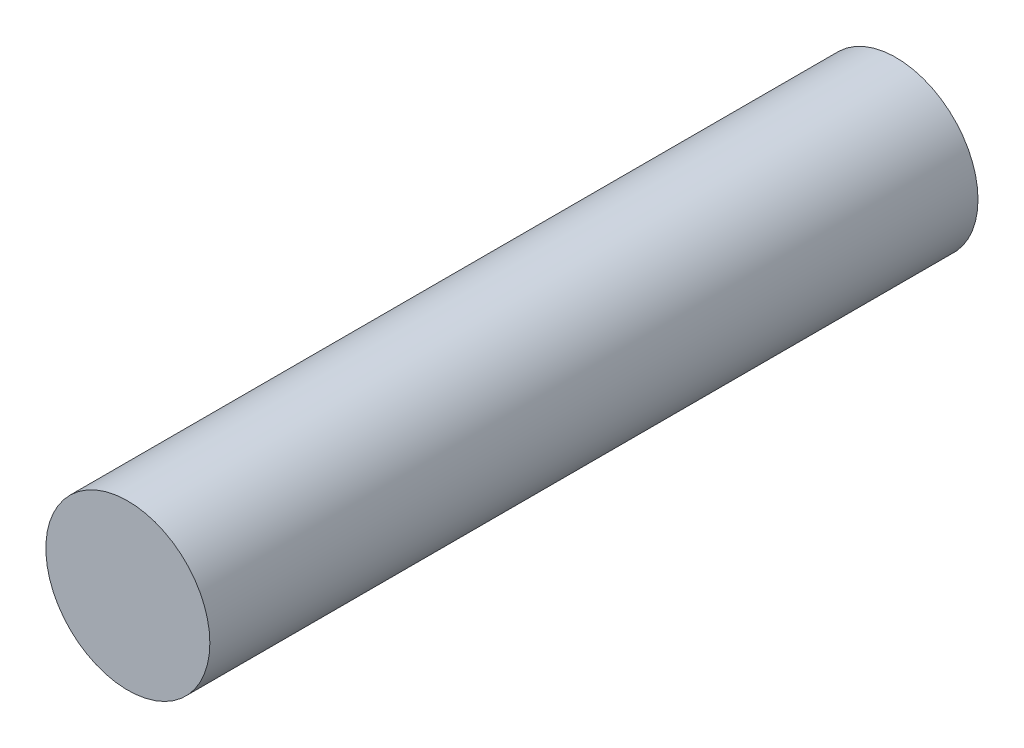
ISO-10303-21;
HEADER;
FILE_DESCRIPTION(('STEP AP214'),'2;1');
FILE_NAME('part.step','',(''),(''),'','','');
FILE_SCHEMA(('AUTOMOTIVE_DESIGN { 1 0 10303 214 1 1 1 1 }'));
ENDSEC;
DATA;
#1=APPLICATION_CONTEXT('core data for automotive mechanical design processes');
#2=APPLICATION_PROTOCOL_DEFINITION('international standard','automotive_design',2000,#1);
#3=PRODUCT_CONTEXT('',#1,'mechanical');
#4=PRODUCT('Part','Part','',(#3));
#5=PRODUCT_RELATED_PRODUCT_CATEGORY('part','',(#4));
#6=PRODUCT_DEFINITION_FORMATION('','',#4);
#7=PRODUCT_DEFINITION_CONTEXT('part definition',#1,'design');
#8=PRODUCT_DEFINITION('design','',#6,#7);
#9=PRODUCT_DEFINITION_SHAPE('','',#8);
#10=(LENGTH_UNIT() NAMED_UNIT(*) SI_UNIT(.MILLI.,.METRE.));
#11=(NAMED_UNIT(*) PLANE_ANGLE_UNIT() SI_UNIT($,.RADIAN.));
#12=(NAMED_UNIT(*) SI_UNIT($,.STERADIAN.) SOLID_ANGLE_UNIT());
#13=UNCERTAINTY_MEASURE_WITH_UNIT(LENGTH_MEASURE(1.E-05),#10,'distance_accuracy_value','');
#14=(GEOMETRIC_REPRESENTATION_CONTEXT(3) GLOBAL_UNCERTAINTY_ASSIGNED_CONTEXT((#13)) GLOBAL_UNIT_ASSIGNED_CONTEXT((#10,
#11,#12)) REPRESENTATION_CONTEXT('',''));
#15=CARTESIAN_POINT('',(0.,0.,0.));
#16=DIRECTION('',(0.,0.,1.));
#17=DIRECTION('',(1.,0.,0.));
#18=AXIS2_PLACEMENT_3D('',#15,#16,#17);
#19=CARTESIAN_POINT('',(0.,0.,28.1));
#20=DIRECTION('',(0.,0.,-1.));
#21=DIRECTION('',(-1.,0.,0.));
#22=AXIS2_PLACEMENT_3D('',#19,#20,#21);
#23=CYLINDRICAL_SURFACE('',#22,3.);
#24=CARTESIAN_POINT('',(0.,0.,28.1));
#25=DIRECTION('',(0.,0.,1.));
#26=DIRECTION('',(1.,0.,0.));
#27=AXIS2_PLACEMENT_3D('',#24,#25,#26);
#28=CIRCLE('',#27,3.);
#29=CARTESIAN_POINT('',(3.,0.,28.1));
#30=VERTEX_POINT('',#29);
#31=EDGE_CURVE('E10',#30,#30,#28,.T.);
#32=ORIENTED_EDGE('',*,*,#31,.F.);
#33=EDGE_LOOP('',(#32));
#34=FACE_BOUND('',#33,.T.);
#35=CARTESIAN_POINT('',(0.,0.,0.));
#36=DIRECTION('',(0.,0.,1.));
#37=DIRECTION('',(1.,0.,0.));
#38=AXIS2_PLACEMENT_3D('',#35,#36,#37);
#39=CIRCLE('',#38,3.);
#40=CARTESIAN_POINT('',(3.,0.,0.));
#41=VERTEX_POINT('',#40);
#42=EDGE_CURVE('E43',#41,#41,#39,.T.);
#43=ORIENTED_EDGE('',*,*,#42,.T.);
#44=EDGE_LOOP('',(#43));
#45=FACE_BOUND('',#44,.T.);
#46=ADVANCED_FACE('F40',(#34,#45),#23,.T.);
#47=CARTESIAN_POINT('',(0.,0.,28.1));
#48=DIRECTION('',(0.,0.,1.));
#49=DIRECTION('',(1.,0.,0.));
#50=AXIS2_PLACEMENT_3D('',#47,#48,#49);
#51=PLANE('',#50);
#52=ORIENTED_EDGE('',*,*,#31,.T.);
#53=EDGE_LOOP('',(#52));
#54=FACE_BOUND('',#53,.T.);
#55=ADVANCED_FACE('F57',(#54),#51,.T.);
#56=CARTESIAN_POINT('',(0.,0.,0.));
#57=DIRECTION('',(0.,0.,1.));
#58=DIRECTION('',(1.,0.,0.));
#59=AXIS2_PLACEMENT_3D('',#56,#57,#58);
#60=PLANE('',#59);
#61=ORIENTED_EDGE('',*,*,#42,.F.);
#62=EDGE_LOOP('',(#61));
#63=FACE_BOUND('',#62,.T.);
#64=ADVANCED_FACE('F55',(#63),#60,.F.);
#65=CLOSED_SHELL('',(#46,#55,#64));
#66=MANIFOLD_SOLID_BREP('B2',#65);
#67=ADVANCED_BREP_SHAPE_REPRESENTATION('',(#18,#66),#14);
#68=SHAPE_DEFINITION_REPRESENTATION(#9,#67);
ENDSEC;
END-ISO-10303-21;
